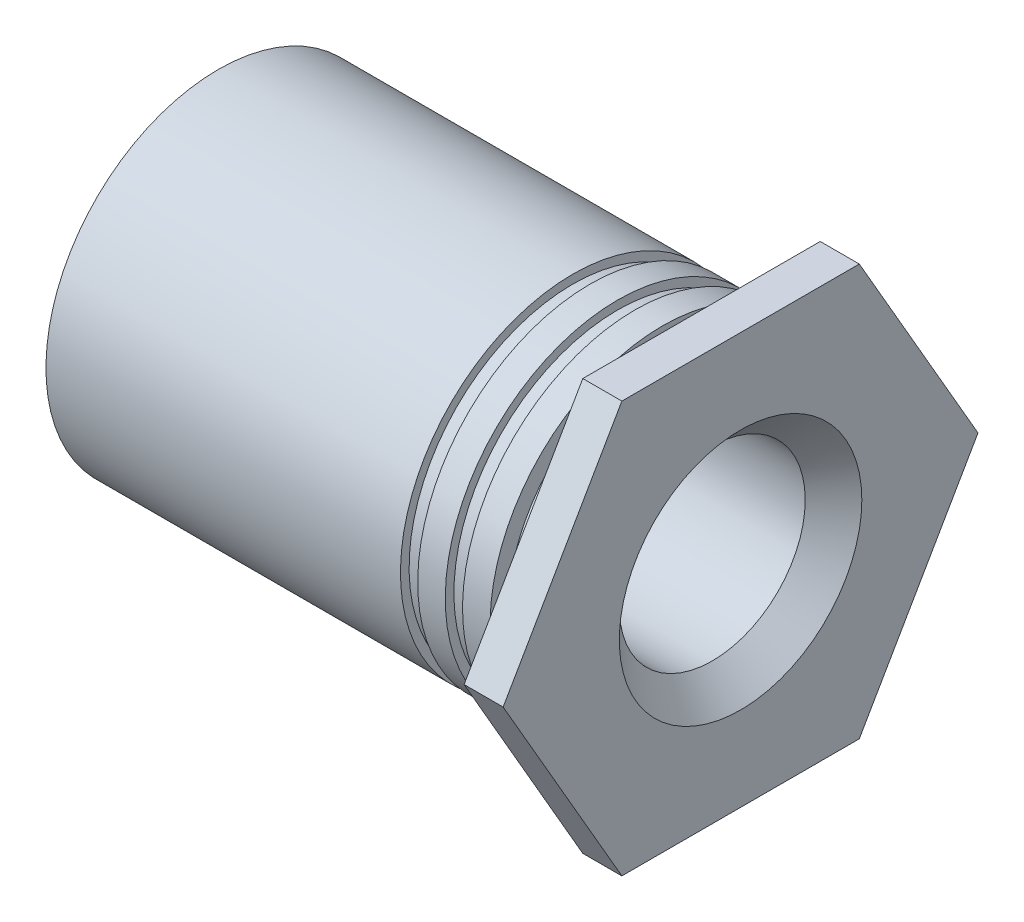
ISO-10303-21;
HEADER;
FILE_DESCRIPTION(('STEP AP214'),'2;1');
FILE_NAME('part.step','',(''),(''),'','','');
FILE_SCHEMA(('AUTOMOTIVE_DESIGN { 1 0 10303 214 1 1 1 1 }'));
ENDSEC;
DATA;
#1=APPLICATION_CONTEXT('core data for automotive mechanical design processes');
#2=APPLICATION_PROTOCOL_DEFINITION('international standard','automotive_design',2000,#1);
#3=PRODUCT_CONTEXT('',#1,'mechanical');
#4=PRODUCT('Part','Part','',(#3));
#5=PRODUCT_RELATED_PRODUCT_CATEGORY('part','',(#4));
#6=PRODUCT_DEFINITION_FORMATION('','',#4);
#7=PRODUCT_DEFINITION_CONTEXT('part definition',#1,'design');
#8=PRODUCT_DEFINITION('design','',#6,#7);
#9=PRODUCT_DEFINITION_SHAPE('','',#8);
#10=(LENGTH_UNIT() NAMED_UNIT(*) SI_UNIT(.MILLI.,.METRE.));
#11=(NAMED_UNIT(*) PLANE_ANGLE_UNIT() SI_UNIT($,.RADIAN.));
#12=(NAMED_UNIT(*) SI_UNIT($,.STERADIAN.) SOLID_ANGLE_UNIT());
#13=UNCERTAINTY_MEASURE_WITH_UNIT(LENGTH_MEASURE(1.E-05),#10,'distance_accuracy_value','');
#14=(GEOMETRIC_REPRESENTATION_CONTEXT(3) GLOBAL_UNCERTAINTY_ASSIGNED_CONTEXT((#13)) GLOBAL_UNIT_ASSIGNED_CONTEXT((#10,
#11,#12)) REPRESENTATION_CONTEXT('',''));
#15=CARTESIAN_POINT('',(0.,0.,0.));
#16=DIRECTION('',(0.,0.,1.));
#17=DIRECTION('',(1.,0.,0.));
#18=AXIS2_PLACEMENT_3D('',#15,#16,#17);
#19=CARTESIAN_POINT('',(-0.47498,1.88595000000011,-1.38777878078145E-13));
#20=DIRECTION('',(1.,0.,0.));
#21=DIRECTION('',(0.,1.,0.));
#22=AXIS2_PLACEMENT_3D('',#19,#20,#21);
#23=PLANE('',#22);
#24=CARTESIAN_POINT('',(-0.47498,0.,0.));
#25=DIRECTION('',(1.,0.,0.));
#26=DIRECTION('',(0.,1.,0.));
#27=AXIS2_PLACEMENT_3D('',#24,#25,#26);
#28=CIRCLE('',#27,1.88595000000002);
#29=CARTESIAN_POINT('',(-0.47498,1.88595000000002,0.));
#30=VERTEX_POINT('',#29);
#31=EDGE_CURVE('E20',#30,#30,#28,.T.);
#32=ORIENTED_EDGE('',*,*,#31,.F.);
#33=EDGE_LOOP('',(#32));
#34=FACE_BOUND('',#33,.T.);
#35=CARTESIAN_POINT('',(-0.47498,0.,0.));
#36=DIRECTION('',(1.,0.,0.));
#37=DIRECTION('',(0.,1.,0.));
#38=AXIS2_PLACEMENT_3D('',#35,#36,#37);
#39=CIRCLE('',#38,2.09550000000002);
#40=CARTESIAN_POINT('',(-0.47498,2.09550000000002,0.));
#41=VERTEX_POINT('',#40);
#42=EDGE_CURVE('E131',#41,#41,#39,.F.);
#43=ORIENTED_EDGE('',*,*,#42,.F.);
#44=EDGE_LOOP('',(#43));
#45=FACE_BOUND('',#44,.T.);
#46=ADVANCED_FACE('F17',(#34,#45),#23,.T.);
#47=CARTESIAN_POINT('',(-5.87502,0.,0.));
#48=DIRECTION('',(1.,0.,0.));
#49=DIRECTION('',(0.,1.,0.));
#50=AXIS2_PLACEMENT_3D('',#47,#48,#49);
#51=CYLINDRICAL_SURFACE('',#50,1.88595000000002);
#52=CARTESIAN_POINT('',(0.,0.,0.));
#53=DIRECTION('',(1.,0.,0.));
#54=DIRECTION('',(0.,1.,0.));
#55=AXIS2_PLACEMENT_3D('',#52,#53,#54);
#56=CIRCLE('',#55,1.88595000000002);
#57=CARTESIAN_POINT('',(0.,1.88595000000002,0.));
#58=VERTEX_POINT('',#57);
#59=EDGE_CURVE('E129',#58,#58,#56,.T.);
#60=ORIENTED_EDGE('',*,*,#59,.F.);
#61=EDGE_LOOP('',(#60));
#62=FACE_BOUND('',#61,.T.);
#63=ORIENTED_EDGE('',*,*,#31,.T.);
#64=EDGE_LOOP('',(#63));
#65=FACE_BOUND('',#64,.T.);
#66=ADVANCED_FACE('F138',(#62,#65),#51,.T.);
#67=CARTESIAN_POINT('',(-5.87502,0.,0.));
#68=DIRECTION('',(1.,0.,0.));
#69=DIRECTION('',(0.,1.,0.));
#70=AXIS2_PLACEMENT_3D('',#67,#68,#69);
#71=CYLINDRICAL_SURFACE('',#70,2.09550000000002);
#72=CARTESIAN_POINT('',(-0.81026,0.,0.));
#73=DIRECTION('',(1.,0.,0.));
#74=DIRECTION('',(0.,1.,0.));
#75=AXIS2_PLACEMENT_3D('',#72,#73,#74);
#76=CIRCLE('',#75,2.09550000000002);
#77=CARTESIAN_POINT('',(-0.81026,2.09550000000002,0.));
#78=VERTEX_POINT('',#77);
#79=EDGE_CURVE('E79',#78,#78,#76,.F.);
#80=ORIENTED_EDGE('',*,*,#79,.F.);
#81=EDGE_LOOP('',(#80));
#82=FACE_BOUND('',#81,.T.);
#83=ORIENTED_EDGE('',*,*,#42,.T.);
#84=EDGE_LOOP('',(#83));
#85=FACE_BOUND('',#84,.T.);
#86=ADVANCED_FACE('F146',(#82,#85),#71,.T.);
#87=CARTESIAN_POINT('',(0.,0.,0.));
#88=DIRECTION('',(-1.,0.,0.));
#89=DIRECTION('',(0.,-1.,0.));
#90=AXIS2_PLACEMENT_3D('',#87,#88,#89);
#91=PLANE('',#90);
#92=DIRECTION('',(0.,0.,-1.));
#93=VECTOR('',#92,1.);
#94=CARTESIAN_POINT('',(0.,-2.49999999999986,-1.44337567297423));
#95=LINE('',#94,#93);
#96=CARTESIAN_POINT('',(0.,-2.49999999999987,1.44337567297378));
#97=VERTEX_POINT('',#96);
#98=CARTESIAN_POINT('',(0.,-2.49999999999987,-1.44337567297425));
#99=VERTEX_POINT('',#98);
#100=EDGE_CURVE('E388',#97,#99,#95,.T.);
#101=ORIENTED_EDGE('',*,*,#100,.F.);
#102=DIRECTION('',(0.,-0.866025403784438,-0.5));
#103=VECTOR('',#102,1.);
#104=CARTESIAN_POINT('',(0.,-2.49999999999993,1.44337567297376));
#105=LINE('',#104,#103);
#106=CARTESIAN_POINT('',(0.,2.4248768967411E-13,2.88675134594796));
#107=VERTEX_POINT('',#106);
#108=EDGE_CURVE('E389',#107,#97,#105,.T.);
#109=ORIENTED_EDGE('',*,*,#108,.F.);
#110=DIRECTION('',(0.,-0.866025403784438,0.500000000000001));
#111=VECTOR('',#110,1.);
#112=CARTESIAN_POINT('',(0.,3.05318602565992E-13,2.88675134594793));
#113=LINE('',#112,#111);
#114=CARTESIAN_POINT('',(0.,2.50000000000024,1.44337567297381));
#115=VERTEX_POINT('',#114);
#116=EDGE_CURVE('E76',#115,#107,#113,.T.);
#117=ORIENTED_EDGE('',*,*,#116,.F.);
#118=DIRECTION('',(0.,0.,1.));
#119=VECTOR('',#118,1.);
#120=CARTESIAN_POINT('',(0.,2.50000000000022,1.44337567297378));
#121=LINE('',#120,#119);
#122=CARTESIAN_POINT('',(0.,2.50000000000027,-1.44337567297442));
#123=VERTEX_POINT('',#122);
#124=EDGE_CURVE('E71',#123,#115,#121,.T.);
#125=ORIENTED_EDGE('',*,*,#124,.F.);
#126=DIRECTION('',(0.,0.866025403784438,0.5));
#127=VECTOR('',#126,1.);
#128=CARTESIAN_POINT('',(0.,2.50000000000041,-1.44337567297437));
#129=LINE('',#128,#127);
#130=CARTESIAN_POINT('',(0.,1.42873979054764E-13,-2.88675134594842));
#131=VERTEX_POINT('',#130);
#132=EDGE_CURVE('E68',#131,#123,#129,.T.);
#133=ORIENTED_EDGE('',*,*,#132,.F.);
#134=DIRECTION('',(0.,0.866025403784439,-0.5));
#135=VECTOR('',#134,1.);
#136=CARTESIAN_POINT('',(0.,1.17968467160497E-13,-2.88675134594837));
#137=LINE('',#136,#135);
#138=EDGE_CURVE('E88',#99,#131,#137,.T.);
#139=ORIENTED_EDGE('',*,*,#138,.F.);
#140=EDGE_LOOP('',(#101,#109,#117,#125,#133,#139));
#141=FACE_BOUND('',#140,.T.);
#142=ORIENTED_EDGE('',*,*,#59,.T.);
#143=EDGE_LOOP('',(#142));
#144=FACE_BOUND('',#143,.T.);
#145=ADVANCED_FACE('F73',(#141,#144),#91,.T.);
#146=CARTESIAN_POINT('',(-0.81026,2.09550000000023,-2.4980018054066E-13));
#147=DIRECTION('',(-1.,0.,0.));
#148=DIRECTION('',(0.,-1.,0.));
#149=AXIS2_PLACEMENT_3D('',#146,#147,#148);
#150=PLANE('',#149);
#151=ORIENTED_EDGE('',*,*,#79,.T.);
#152=EDGE_LOOP('',(#151));
#153=FACE_BOUND('',#152,.T.);
#154=CARTESIAN_POINT('',(-0.81026,0.,0.));
#155=DIRECTION('',(1.,0.,0.));
#156=DIRECTION('',(0.,1.,0.));
#157=AXIS2_PLACEMENT_3D('',#154,#155,#156);
#158=CIRCLE('',#157,1.99072500000002);
#159=CARTESIAN_POINT('',(-0.81026,1.99072500000002,0.));
#160=VERTEX_POINT('',#159);
#161=EDGE_CURVE('E123',#160,#160,#158,.F.);
#162=ORIENTED_EDGE('',*,*,#161,.F.);
#163=EDGE_LOOP('',(#162));
#164=FACE_BOUND('',#163,.T.);
#165=ADVANCED_FACE('F219',(#153,#164),#150,.T.);
#166=CARTESIAN_POINT('',(0.47498,2.50000000000022,1.44337567297378));
#167=DIRECTION('',(0.,1.,0.));
#168=DIRECTION('',(0.,0.,1.));
#169=AXIS2_PLACEMENT_3D('',#166,#167,#168);
#170=PLANE('',#169);
#171=DIRECTION('',(0.,0.,1.));
#172=VECTOR('',#171,1.);
#173=CARTESIAN_POINT('',(0.47498,2.50000000000022,0.));
#174=LINE('',#173,#172);
#175=CARTESIAN_POINT('',(0.47498,2.50000000000024,1.44337567297381));
#176=VERTEX_POINT('',#175);
#177=CARTESIAN_POINT('',(0.47498,2.50000000000027,-1.44337567297439));
#178=VERTEX_POINT('',#177);
#179=EDGE_CURVE('E85',#176,#178,#174,.F.);
#180=ORIENTED_EDGE('',*,*,#179,.T.);
#181=DIRECTION('',(1.,0.,0.));
#182=VECTOR('',#181,1.);
#183=CARTESIAN_POINT('',(0.47498,2.50000000000041,-1.44337567297437));
#184=LINE('',#183,#182);
#185=EDGE_CURVE('E82',#123,#178,#184,.T.);
#186=ORIENTED_EDGE('',*,*,#185,.F.);
#187=ORIENTED_EDGE('',*,*,#124,.T.);
#188=DIRECTION('',(1.,0.,0.));
#189=VECTOR('',#188,1.);
#190=CARTESIAN_POINT('',(0.47498,2.50000000000028,1.44337567297388));
#191=LINE('',#190,#189);
#192=EDGE_CURVE('E126',#176,#115,#191,.F.);
#193=ORIENTED_EDGE('',*,*,#192,.F.);
#194=EDGE_LOOP('',(#180,#186,#187,#193));
#195=FACE_BOUND('',#194,.T.);
#196=ADVANCED_FACE('F83',(#195),#170,.T.);
#197=CARTESIAN_POINT('',(0.47498,2.50000000000041,-1.44337567297437));
#198=DIRECTION('',(0.,0.5,-0.866025403784438));
#199=DIRECTION('',(0.,0.866025403784438,0.5));
#200=AXIS2_PLACEMENT_3D('',#197,#198,#199);
#201=PLANE('',#200);
#202=DIRECTION('',(0.,-0.866025403784473,-0.499999999999941));
#203=VECTOR('',#202,1.);
#204=CARTESIAN_POINT('',(0.47498,2.50000000000041,-1.44337567297437));
#205=LINE('',#204,#203);
#206=CARTESIAN_POINT('',(0.47498,1.67496875986507E-13,-2.88675134594846));
#207=VERTEX_POINT('',#206);
#208=EDGE_CURVE('E385',#178,#207,#205,.T.);
#209=ORIENTED_EDGE('',*,*,#208,.T.);
#210=DIRECTION('',(1.,0.,0.));
#211=VECTOR('',#210,1.);
#212=CARTESIAN_POINT('',(0.47498,1.17966649461979E-13,-2.88675134594837));
#213=LINE('',#212,#211);
#214=EDGE_CURVE('E92',#131,#207,#213,.T.);
#215=ORIENTED_EDGE('',*,*,#214,.F.);
#216=ORIENTED_EDGE('',*,*,#132,.T.);
#217=ORIENTED_EDGE('',*,*,#185,.T.);
#218=EDGE_LOOP('',(#209,#215,#216,#217));
#219=FACE_BOUND('',#218,.T.);
#220=ADVANCED_FACE('F90',(#219),#201,.T.);
#221=CARTESIAN_POINT('',(0.47498,1.17961196366423E-13,-2.88675134594837));
#222=DIRECTION('',(0.,-0.5,-0.866025403784439));
#223=DIRECTION('',(0.,0.866025403784439,-0.5));
#224=AXIS2_PLACEMENT_3D('',#221,#222,#223);
#225=PLANE('',#224);
#226=DIRECTION('',(0.,-0.866025403784424,0.500000000000025));
#227=VECTOR('',#226,1.);
#228=CARTESIAN_POINT('',(0.47498,1.17961196366423E-13,-2.88675134594837));
#229=LINE('',#228,#227);
#230=CARTESIAN_POINT('',(0.47498,-2.49999999999988,-1.44337567297427));
#231=VERTEX_POINT('',#230);
#232=EDGE_CURVE('E379',#207,#231,#229,.T.);
#233=ORIENTED_EDGE('',*,*,#232,.T.);
#234=DIRECTION('',(1.,0.,0.));
#235=VECTOR('',#234,1.);
#236=CARTESIAN_POINT('',(0.47498,-2.49999999999986,-1.44337567297423));
#237=LINE('',#236,#235);
#238=EDGE_CURVE('E381',#99,#231,#237,.T.);
#239=ORIENTED_EDGE('',*,*,#238,.F.);
#240=ORIENTED_EDGE('',*,*,#138,.T.);
#241=ORIENTED_EDGE('',*,*,#214,.T.);
#242=EDGE_LOOP('',(#233,#239,#240,#241));
#243=FACE_BOUND('',#242,.T.);
#244=ADVANCED_FACE('F210',(#243),#225,.T.);
#245=CARTESIAN_POINT('',(0.47498,-2.49999999999986,-1.44337567297423));
#246=DIRECTION('',(0.,-1.,0.));
#247=DIRECTION('',(0.,0.,-1.));
#248=AXIS2_PLACEMENT_3D('',#245,#246,#247);
#249=PLANE('',#248);
#250=DIRECTION('',(0.,0.,1.));
#251=VECTOR('',#250,1.);
#252=CARTESIAN_POINT('',(0.47498,-2.49999999999986,0.));
#253=LINE('',#252,#251);
#254=CARTESIAN_POINT('',(0.47498,-2.49999999999987,1.44337567297377));
#255=VERTEX_POINT('',#254);
#256=EDGE_CURVE('E384',#231,#255,#253,.T.);
#257=ORIENTED_EDGE('',*,*,#256,.T.);
#258=DIRECTION('',(1.,0.,0.));
#259=VECTOR('',#258,1.);
#260=CARTESIAN_POINT('',(0.47498,-2.49999999999993,1.44337567297376));
#261=LINE('',#260,#259);
#262=EDGE_CURVE('E403',#97,#255,#261,.T.);
#263=ORIENTED_EDGE('',*,*,#262,.F.);
#264=ORIENTED_EDGE('',*,*,#100,.T.);
#265=ORIENTED_EDGE('',*,*,#238,.T.);
#266=EDGE_LOOP('',(#257,#263,#264,#265));
#267=FACE_BOUND('',#266,.T.);
#268=ADVANCED_FACE('F207',(#267),#249,.T.);
#269=CARTESIAN_POINT('',(0.47498,-2.49999999999993,1.44337567297376));
#270=DIRECTION('',(0.,-0.5,0.866025403784438));
#271=DIRECTION('',(0.,-0.866025403784438,-0.5));
#272=AXIS2_PLACEMENT_3D('',#269,#270,#271);
#273=PLANE('',#272);
#274=DIRECTION('',(0.,0.866025403784442,0.499999999999994));
#275=VECTOR('',#274,1.);
#276=CARTESIAN_POINT('',(0.47498,-2.49999999999993,1.44337567297376));
#277=LINE('',#276,#275);
#278=CARTESIAN_POINT('',(0.47498,2.80971601747689E-13,2.88675134594795));
#279=VERTEX_POINT('',#278);
#280=EDGE_CURVE('E35',#255,#279,#277,.T.);
#281=ORIENTED_EDGE('',*,*,#280,.T.);
#282=DIRECTION('',(1.,0.,0.));
#283=VECTOR('',#282,1.);
#284=CARTESIAN_POINT('',(0.47498,2.30874220264305E-13,2.88675134594797));
#285=LINE('',#284,#283);
#286=EDGE_CURVE('E400',#107,#279,#285,.T.);
#287=ORIENTED_EDGE('',*,*,#286,.F.);
#288=ORIENTED_EDGE('',*,*,#108,.T.);
#289=ORIENTED_EDGE('',*,*,#262,.T.);
#290=EDGE_LOOP('',(#281,#287,#288,#289));
#291=FACE_BOUND('',#290,.T.);
#292=ADVANCED_FACE('F203',(#291),#273,.T.);
#293=CARTESIAN_POINT('',(0.47498,3.05311331771918E-13,2.88675134594793));
#294=DIRECTION('',(0.,0.500000000000001,0.866025403784438));
#295=DIRECTION('',(0.,-0.866025403784438,0.500000000000001));
#296=AXIS2_PLACEMENT_3D('',#293,#294,#295);
#297=PLANE('',#296);
#298=DIRECTION('',(0.,0.86602540378442,-0.500000000000033));
#299=VECTOR('',#298,1.);
#300=CARTESIAN_POINT('',(0.47498,3.05311331771918E-13,2.88675134594793));
#301=LINE('',#300,#299);
#302=EDGE_CURVE('E122',#279,#176,#301,.T.);
#303=ORIENTED_EDGE('',*,*,#302,.T.);
#304=ORIENTED_EDGE('',*,*,#192,.T.);
#305=ORIENTED_EDGE('',*,*,#116,.T.);
#306=ORIENTED_EDGE('',*,*,#286,.T.);
#307=EDGE_LOOP('',(#303,#304,#305,#306));
#308=FACE_BOUND('',#307,.T.);
#309=ADVANCED_FACE('F199',(#308),#297,.T.);
#310=CARTESIAN_POINT('',(-5.87502,0.,0.));
#311=DIRECTION('',(1.,0.,0.));
#312=DIRECTION('',(0.,1.,0.));
#313=AXIS2_PLACEMENT_3D('',#310,#311,#312);
#314=CYLINDRICAL_SURFACE('',#313,1.99072500000002);
#315=CARTESIAN_POINT('',(-1.01981,0.,0.));
#316=DIRECTION('',(1.,0.,0.));
#317=DIRECTION('',(0.,1.,0.));
#318=AXIS2_PLACEMENT_3D('',#315,#316,#317);
#319=CIRCLE('',#318,1.99072500000002);
#320=CARTESIAN_POINT('',(-1.01981,1.99072500000002,0.));
#321=VERTEX_POINT('',#320);
#322=EDGE_CURVE('E119',#321,#321,#319,.F.);
#323=ORIENTED_EDGE('',*,*,#322,.F.);
#324=EDGE_LOOP('',(#323));
#325=FACE_BOUND('',#324,.T.);
#326=ORIENTED_EDGE('',*,*,#161,.T.);
#327=EDGE_LOOP('',(#326));
#328=FACE_BOUND('',#327,.T.);
#329=ADVANCED_FACE('F195',(#325,#328),#314,.T.);
#330=CARTESIAN_POINT('',(0.47498,0.,0.));
#331=DIRECTION('',(-1.,0.,0.));
#332=DIRECTION('',(0.,-1.,0.));
#333=AXIS2_PLACEMENT_3D('',#330,#331,#332);
#334=PLANE('',#333);
#335=ORIENTED_EDGE('',*,*,#280,.F.);
#336=ORIENTED_EDGE('',*,*,#256,.F.);
#337=ORIENTED_EDGE('',*,*,#232,.F.);
#338=ORIENTED_EDGE('',*,*,#208,.F.);
#339=ORIENTED_EDGE('',*,*,#179,.F.);
#340=ORIENTED_EDGE('',*,*,#302,.F.);
#341=EDGE_LOOP('',(#335,#336,#337,#338,#339,#340));
#342=FACE_BOUND('',#341,.T.);
#343=CARTESIAN_POINT('',(0.47498000003543,0.,0.));
#344=DIRECTION('',(1.,0.,0.));
#345=DIRECTION('',(0.,0.,-1.));
#346=AXIS2_PLACEMENT_3D('',#343,#344,#345);
#347=CIRCLE('',#346,1.47447000006196);
#348=CARTESIAN_POINT('',(0.47498000003543,0.,-1.47447000006196));
#349=VERTEX_POINT('',#348);
#350=EDGE_CURVE('E116',#349,#349,#347,.F.);
#351=ORIENTED_EDGE('',*,*,#350,.T.);
#352=EDGE_LOOP('',(#351));
#353=FACE_BOUND('',#352,.T.);
#354=ADVANCED_FACE('F191',(#342,#353),#334,.F.);
#355=CARTESIAN_POINT('',(-1.01981,1.99072500000003,0.));
#356=DIRECTION('',(1.,0.,0.));
#357=DIRECTION('',(0.,1.,0.));
#358=AXIS2_PLACEMENT_3D('',#355,#356,#357);
#359=PLANE('',#358);
#360=ORIENTED_EDGE('',*,*,#322,.T.);
#361=EDGE_LOOP('',(#360));
#362=FACE_BOUND('',#361,.T.);
#363=CARTESIAN_POINT('',(-1.01981,0.,0.));
#364=DIRECTION('',(1.,0.,0.));
#365=DIRECTION('',(0.,1.,0.));
#366=AXIS2_PLACEMENT_3D('',#363,#364,#365);
#367=CIRCLE('',#366,2.09550000000002);
#368=CARTESIAN_POINT('',(-1.01981,2.09550000000002,0.));
#369=VERTEX_POINT('',#368);
#370=EDGE_CURVE('E113',#369,#369,#367,.F.);
#371=ORIENTED_EDGE('',*,*,#370,.F.);
#372=EDGE_LOOP('',(#371));
#373=FACE_BOUND('',#372,.T.);
#374=ADVANCED_FACE('F187',(#362,#373),#359,.T.);
#375=CARTESIAN_POINT('',(0.47498000003543,0.,0.));
#376=DIRECTION('',(1.,0.,0.));
#377=DIRECTION('',(0.,0.,-1.));
#378=AXIS2_PLACEMENT_3D('',#375,#376,#377);
#379=CONICAL_SURFACE('',#378,1.47447000006196,0.785398163480029);
#380=CARTESIAN_POINT('',(0.130810000055527,0.,0.));
#381=DIRECTION('',(-1.,0.,0.));
#382=DIRECTION('',(0.,-1.,0.));
#383=AXIS2_PLACEMENT_3D('',#380,#381,#382);
#384=CIRCLE('',#383,1.1303);
#385=CARTESIAN_POINT('',(0.130810000055527,-1.1303,0.));
#386=VERTEX_POINT('',#385);
#387=EDGE_CURVE('E112',#386,#386,#384,.T.);
#388=ORIENTED_EDGE('',*,*,#387,.T.);
#389=EDGE_LOOP('',(#388));
#390=FACE_BOUND('',#389,.T.);
#391=ORIENTED_EDGE('',*,*,#350,.F.);
#392=EDGE_LOOP('',(#391));
#393=FACE_BOUND('',#392,.T.);
#394=ADVANCED_FACE('F183',(#390,#393),#379,.F.);
#395=CARTESIAN_POINT('',(-5.87502,0.,0.));
#396=DIRECTION('',(1.,0.,0.));
#397=DIRECTION('',(0.,1.,0.));
#398=AXIS2_PLACEMENT_3D('',#395,#396,#397);
#399=CYLINDRICAL_SURFACE('',#398,2.09550000000002);
#400=CARTESIAN_POINT('',(-1.35509,0.,0.));
#401=DIRECTION('',(1.,0.,0.));
#402=DIRECTION('',(0.,1.,0.));
#403=AXIS2_PLACEMENT_3D('',#400,#401,#402);
#404=CIRCLE('',#403,2.09550000000002);
#405=CARTESIAN_POINT('',(-1.35509,2.09550000000002,0.));
#406=VERTEX_POINT('',#405);
#407=EDGE_CURVE('E109',#406,#406,#404,.F.);
#408=ORIENTED_EDGE('',*,*,#407,.F.);
#409=EDGE_LOOP('',(#408));
#410=FACE_BOUND('',#409,.T.);
#411=ORIENTED_EDGE('',*,*,#370,.T.);
#412=EDGE_LOOP('',(#411));
#413=FACE_BOUND('',#412,.T.);
#414=ADVANCED_FACE('F179',(#410,#413),#399,.T.);
#415=CARTESIAN_POINT('',(-5.87502,0.,0.));
#416=DIRECTION('',(-1.,0.,0.));
#417=DIRECTION('',(0.,-1.,0.));
#418=AXIS2_PLACEMENT_3D('',#415,#416,#417);
#419=CYLINDRICAL_SURFACE('',#418,1.1303);
#420=ORIENTED_EDGE('',*,*,#387,.F.);
#421=EDGE_LOOP('',(#420));
#422=FACE_BOUND('',#421,.T.);
#423=CARTESIAN_POINT('',(-5.5308499999569,0.,0.));
#424=DIRECTION('',(-1.,0.,0.));
#425=DIRECTION('',(0.,0.,1.));
#426=AXIS2_PLACEMENT_3D('',#423,#424,#425);
#427=CIRCLE('',#426,1.13029999994296);
#428=CARTESIAN_POINT('',(-5.5308499999569,0.,1.13029999994296));
#429=VERTEX_POINT('',#428);
#430=EDGE_CURVE('E108',#429,#429,#427,.T.);
#431=ORIENTED_EDGE('',*,*,#430,.T.);
#432=EDGE_LOOP('',(#431));
#433=FACE_BOUND('',#432,.T.);
#434=ADVANCED_FACE('F175',(#422,#433),#419,.F.);
#435=CARTESIAN_POINT('',(-1.35509,2.09550000000023,-2.4980018054066E-13));
#436=DIRECTION('',(-1.,0.,0.));
#437=DIRECTION('',(0.,-1.,0.));
#438=AXIS2_PLACEMENT_3D('',#435,#436,#437);
#439=PLANE('',#438);
#440=ORIENTED_EDGE('',*,*,#407,.T.);
#441=EDGE_LOOP('',(#440));
#442=FACE_BOUND('',#441,.T.);
#443=CARTESIAN_POINT('',(-1.35509,0.,0.));
#444=DIRECTION('',(1.,0.,0.));
#445=DIRECTION('',(0.,1.,0.));
#446=AXIS2_PLACEMENT_3D('',#443,#444,#445);
#447=CIRCLE('',#446,1.99072500000002);
#448=CARTESIAN_POINT('',(-1.35509,1.99072500000002,0.));
#449=VERTEX_POINT('',#448);
#450=EDGE_CURVE('E105',#449,#449,#447,.F.);
#451=ORIENTED_EDGE('',*,*,#450,.F.);
#452=EDGE_LOOP('',(#451));
#453=FACE_BOUND('',#452,.T.);
#454=ADVANCED_FACE('F171',(#442,#453),#439,.T.);
#455=CARTESIAN_POINT('',(-5.87501999990536,0.,0.));
#456=DIRECTION('',(-1.,0.,0.));
#457=DIRECTION('',(0.,0.,1.));
#458=AXIS2_PLACEMENT_3D('',#455,#456,#457);
#459=CONICAL_SURFACE('',#458,1.47446999983458,0.785398163314868);
#460=ORIENTED_EDGE('',*,*,#430,.F.);
#461=EDGE_LOOP('',(#460));
#462=FACE_BOUND('',#461,.T.);
#463=CARTESIAN_POINT('',(-5.87502000001905,0.,0.));
#464=DIRECTION('',(-1.,0.,0.));
#465=DIRECTION('',(0.,0.,1.));
#466=AXIS2_PLACEMENT_3D('',#463,#464,#465);
#467=CIRCLE('',#466,1.47446999994827);
#468=CARTESIAN_POINT('',(-5.87502000001905,0.,1.47446999994827));
#469=VERTEX_POINT('',#468);
#470=EDGE_CURVE('E102',#469,#469,#467,.F.);
#471=ORIENTED_EDGE('',*,*,#470,.F.);
#472=EDGE_LOOP('',(#471));
#473=FACE_BOUND('',#472,.T.);
#474=ADVANCED_FACE('F167',(#462,#473),#459,.F.);
#475=CARTESIAN_POINT('',(-5.87502,0.,0.));
#476=DIRECTION('',(1.,0.,0.));
#477=DIRECTION('',(0.,1.,0.));
#478=AXIS2_PLACEMENT_3D('',#475,#476,#477);
#479=CYLINDRICAL_SURFACE('',#478,1.99072500000002);
#480=CARTESIAN_POINT('',(-1.56464,0.,0.));
#481=DIRECTION('',(1.,0.,0.));
#482=DIRECTION('',(0.,1.,0.));
#483=AXIS2_PLACEMENT_3D('',#480,#481,#482);
#484=CIRCLE('',#483,1.99072500000002);
#485=CARTESIAN_POINT('',(-1.56464,1.99072500000002,0.));
#486=VERTEX_POINT('',#485);
#487=EDGE_CURVE('E99',#486,#486,#484,.F.);
#488=ORIENTED_EDGE('',*,*,#487,.F.);
#489=EDGE_LOOP('',(#488));
#490=FACE_BOUND('',#489,.T.);
#491=ORIENTED_EDGE('',*,*,#450,.T.);
#492=EDGE_LOOP('',(#491));
#493=FACE_BOUND('',#492,.T.);
#494=ADVANCED_FACE('F163',(#490,#493),#479,.T.);
#495=CARTESIAN_POINT('',(-5.87502,2.09550000000015,-2.22044604925031E-13));
#496=DIRECTION('',(-1.,0.,0.));
#497=DIRECTION('',(0.,-1.,0.));
#498=AXIS2_PLACEMENT_3D('',#495,#496,#497);
#499=PLANE('',#498);
#500=CARTESIAN_POINT('',(-5.87502,0.,0.));
#501=DIRECTION('',(1.,0.,0.));
#502=DIRECTION('',(0.,1.,0.));
#503=AXIS2_PLACEMENT_3D('',#500,#501,#502);
#504=CIRCLE('',#503,2.09550000000002);
#505=CARTESIAN_POINT('',(-5.87502,2.09550000000002,0.));
#506=VERTEX_POINT('',#505);
#507=EDGE_CURVE('E26',#506,#506,#504,.T.);
#508=ORIENTED_EDGE('',*,*,#507,.F.);
#509=EDGE_LOOP('',(#508));
#510=FACE_BOUND('',#509,.T.);
#511=ORIENTED_EDGE('',*,*,#470,.T.);
#512=EDGE_LOOP('',(#511));
#513=FACE_BOUND('',#512,.T.);
#514=ADVANCED_FACE('F156',(#510,#513),#499,.T.);
#515=CARTESIAN_POINT('',(-1.56464,1.99072500000003,0.));
#516=DIRECTION('',(1.,0.,0.));
#517=DIRECTION('',(0.,1.,0.));
#518=AXIS2_PLACEMENT_3D('',#515,#516,#517);
#519=PLANE('',#518);
#520=ORIENTED_EDGE('',*,*,#487,.T.);
#521=EDGE_LOOP('',(#520));
#522=FACE_BOUND('',#521,.T.);
#523=CARTESIAN_POINT('',(-1.56464,0.,0.));
#524=DIRECTION('',(1.,0.,0.));
#525=DIRECTION('',(0.,1.,0.));
#526=AXIS2_PLACEMENT_3D('',#523,#524,#525);
#527=CIRCLE('',#526,2.09550000000002);
#528=CARTESIAN_POINT('',(-1.56464,2.09550000000002,0.));
#529=VERTEX_POINT('',#528);
#530=EDGE_CURVE('E11',#529,#529,#527,.F.);
#531=ORIENTED_EDGE('',*,*,#530,.F.);
#532=EDGE_LOOP('',(#531));
#533=FACE_BOUND('',#532,.T.);
#534=ADVANCED_FACE('F150',(#522,#533),#519,.T.);
#535=CARTESIAN_POINT('',(-5.87502,0.,0.));
#536=DIRECTION('',(1.,0.,0.));
#537=DIRECTION('',(0.,1.,0.));
#538=AXIS2_PLACEMENT_3D('',#535,#536,#537);
#539=CYLINDRICAL_SURFACE('',#538,2.09550000000002);
#540=ORIENTED_EDGE('',*,*,#530,.T.);
#541=EDGE_LOOP('',(#540));
#542=FACE_BOUND('',#541,.T.);
#543=ORIENTED_EDGE('',*,*,#507,.T.);
#544=EDGE_LOOP('',(#543));
#545=FACE_BOUND('',#544,.T.);
#546=ADVANCED_FACE('F148',(#542,#545),#539,.T.);
#547=CLOSED_SHELL('',(#46,#66,#86,#145,#165,#196,#220,#244,#268,#292,#309,#329,#354,#374,#394,
#414,#434,#454,#474,#494,#514,#534,#546));
#548=MANIFOLD_SOLID_BREP('B1',#547);
#549=ADVANCED_BREP_SHAPE_REPRESENTATION('',(#18,#548),#14);
#550=SHAPE_DEFINITION_REPRESENTATION(#9,#549);
ENDSEC;
END-ISO-10303-21;
